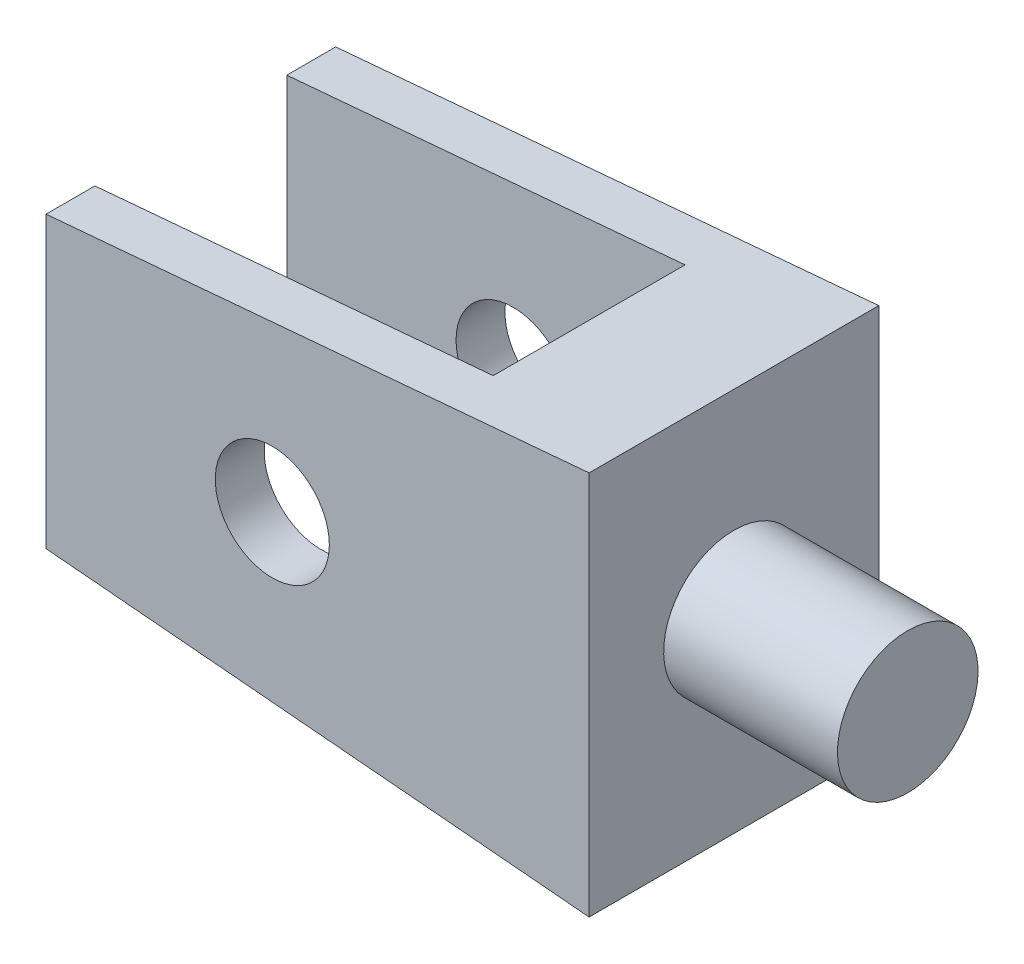
ISO-10303-21;
HEADER;
FILE_DESCRIPTION(('STEP AP214'),'2;1');
FILE_NAME('part.step','',(''),(''),'','','');
FILE_SCHEMA(('AUTOMOTIVE_DESIGN { 1 0 10303 214 1 1 1 1 }'));
ENDSEC;
DATA;
#1=APPLICATION_CONTEXT('core data for automotive mechanical design processes');
#2=APPLICATION_PROTOCOL_DEFINITION('international standard','automotive_design',2000,#1);
#3=PRODUCT_CONTEXT('',#1,'mechanical');
#4=PRODUCT('Part','Part','',(#3));
#5=PRODUCT_RELATED_PRODUCT_CATEGORY('part','',(#4));
#6=PRODUCT_DEFINITION_FORMATION('','',#4);
#7=PRODUCT_DEFINITION_CONTEXT('part definition',#1,'design');
#8=PRODUCT_DEFINITION('design','',#6,#7);
#9=PRODUCT_DEFINITION_SHAPE('','',#8);
#10=(LENGTH_UNIT() NAMED_UNIT(*) SI_UNIT(.MILLI.,.METRE.));
#11=(NAMED_UNIT(*) PLANE_ANGLE_UNIT() SI_UNIT($,.RADIAN.));
#12=(NAMED_UNIT(*) SI_UNIT($,.STERADIAN.) SOLID_ANGLE_UNIT());
#13=UNCERTAINTY_MEASURE_WITH_UNIT(LENGTH_MEASURE(1.E-05),#10,'distance_accuracy_value','');
#14=(GEOMETRIC_REPRESENTATION_CONTEXT(3) GLOBAL_UNCERTAINTY_ASSIGNED_CONTEXT((#13)) GLOBAL_UNIT_ASSIGNED_CONTEXT((#10,
#11,#12)) REPRESENTATION_CONTEXT('',''));
#15=CARTESIAN_POINT('',(0.,0.,0.));
#16=DIRECTION('',(0.,0.,1.));
#17=DIRECTION('',(1.,0.,0.));
#18=AXIS2_PLACEMENT_3D('',#15,#16,#17);
#19=CARTESIAN_POINT('',(0.,23.4932723213509,20.32));
#20=DIRECTION('',(0.0871557427476594,-0.996194698091745,0.));
#21=DIRECTION('',(0.996194698091746,0.0871557427476594,0.));
#22=AXIS2_PLACEMENT_3D('',#19,#20,#21);
#23=PLANE('',#22);
#24=DIRECTION('',(0.,0.,1.));
#25=VECTOR('',#24,1.);
#26=CARTESIAN_POINT('',(-114.3,13.4933180803377,20.32));
#27=LINE('',#26,#25);
#28=CARTESIAN_POINT('',(-114.3,13.4933180803377,0.));
#29=VERTEX_POINT('',#28);
#30=CARTESIAN_POINT('',(-114.3,13.4933180803377,20.32));
#31=VERTEX_POINT('',#30);
#32=EDGE_CURVE('E137',#29,#31,#27,.T.);
#33=ORIENTED_EDGE('',*,*,#32,.F.);
#34=DIRECTION('',(-0.996194698091745,-0.0871557427476594,0.));
#35=VECTOR('',#34,1.);
#36=CARTESIAN_POINT('',(0.,23.4932723213509,0.));
#37=LINE('',#36,#35);
#38=CARTESIAN_POINT('',(-152.4,10.1599999999999,0.));
#39=VERTEX_POINT('',#38);
#40=EDGE_CURVE('E100',#29,#39,#37,.T.);
#41=ORIENTED_EDGE('',*,*,#40,.T.);
#42=DIRECTION('',(0.,0.,-1.));
#43=VECTOR('',#42,1.);
#44=CARTESIAN_POINT('',(-152.4,10.1599999999999,20.32));
#45=LINE('',#44,#43);
#46=CARTESIAN_POINT('',(-152.4,10.16,3.429));
#47=VERTEX_POINT('',#46);
#48=EDGE_CURVE('E97',#47,#39,#45,.T.);
#49=ORIENTED_EDGE('',*,*,#48,.F.);
#50=DIRECTION('',(0.996194698091746,0.0871557427476594,0.));
#51=VECTOR('',#50,1.);
#52=CARTESIAN_POINT('',(0.,23.4932723213509,3.429));
#53=LINE('',#52,#51);
#54=CARTESIAN_POINT('',(-124.46,12.6044332589143,3.429));
#55=VERTEX_POINT('',#54);
#56=EDGE_CURVE('E164',#47,#55,#53,.T.);
#57=ORIENTED_EDGE('',*,*,#56,.T.);
#58=DIRECTION('',(0.,0.,1.));
#59=VECTOR('',#58,1.);
#60=CARTESIAN_POINT('',(-124.46,12.6044332589143,20.32));
#61=LINE('',#60,#59);
#62=CARTESIAN_POINT('',(-124.46,12.6044332589143,16.891));
#63=VERTEX_POINT('',#62);
#64=EDGE_CURVE('E170',#55,#63,#61,.T.);
#65=ORIENTED_EDGE('',*,*,#64,.T.);
#66=DIRECTION('',(-0.996194698091746,-0.0871557427476594,0.));
#67=VECTOR('',#66,1.);
#68=CARTESIAN_POINT('',(0.,23.4932723213509,16.891));
#69=LINE('',#68,#67);
#70=CARTESIAN_POINT('',(-152.4,10.16,16.891));
#71=VERTEX_POINT('',#70);
#72=EDGE_CURVE('E178',#63,#71,#69,.T.);
#73=ORIENTED_EDGE('',*,*,#72,.T.);
#74=CARTESIAN_POINT('',(-152.4,10.1599999999999,20.32));
#75=VERTEX_POINT('',#74);
#76=EDGE_CURVE('E110',#75,#71,#45,.T.);
#77=ORIENTED_EDGE('',*,*,#76,.F.);
#78=DIRECTION('',(-0.996194698091745,-0.0871557427476594,0.));
#79=VECTOR('',#78,1.);
#80=CARTESIAN_POINT('',(0.,23.4932723213509,20.32));
#81=LINE('',#80,#79);
#82=EDGE_CURVE('E104',#31,#75,#81,.T.);
#83=ORIENTED_EDGE('',*,*,#82,.F.);
#84=EDGE_LOOP('',(#33,#41,#49,#57,#65,#73,#77,#83));
#85=FACE_BOUND('',#84,.T.);
#86=ADVANCED_FACE('F39',(#85),#23,.F.);
#87=CARTESIAN_POINT('',(-152.4,-10.1600000000001,20.32));
#88=DIRECTION('',(0.0871557427476576,0.996194698091746,0.));
#89=DIRECTION('',(-0.996194698091746,0.0871557427476576,0.));
#90=AXIS2_PLACEMENT_3D('',#87,#88,#89);
#91=PLANE('',#90);
#92=DIRECTION('',(0.,0.,-1.));
#93=VECTOR('',#92,1.);
#94=CARTESIAN_POINT('',(-114.3,-13.4933180803378,20.32));
#95=LINE('',#94,#93);
#96=CARTESIAN_POINT('',(-114.3,-13.4933180803378,20.32));
#97=VERTEX_POINT('',#96);
#98=CARTESIAN_POINT('',(-114.3,-13.4933180803378,0.));
#99=VERTEX_POINT('',#98);
#100=EDGE_CURVE('E54',#97,#99,#95,.T.);
#101=ORIENTED_EDGE('',*,*,#100,.F.);
#102=DIRECTION('',(0.996194698091746,-0.0871557427476576,0.));
#103=VECTOR('',#102,1.);
#104=CARTESIAN_POINT('',(-152.4,-10.1600000000001,20.32));
#105=LINE('',#104,#103);
#106=CARTESIAN_POINT('',(-152.4,-10.1600000000001,20.32));
#107=VERTEX_POINT('',#106);
#108=EDGE_CURVE('E90',#107,#97,#105,.T.);
#109=ORIENTED_EDGE('',*,*,#108,.F.);
#110=DIRECTION('',(0.,0.,-1.));
#111=VECTOR('',#110,1.);
#112=CARTESIAN_POINT('',(-152.4,-10.1600000000001,20.32));
#113=LINE('',#112,#111);
#114=CARTESIAN_POINT('',(-152.4,-10.16,16.891));
#115=VERTEX_POINT('',#114);
#116=EDGE_CURVE('E89',#107,#115,#113,.T.);
#117=ORIENTED_EDGE('',*,*,#116,.T.);
#118=DIRECTION('',(0.996194698091746,-0.0871557427476576,0.));
#119=VECTOR('',#118,1.);
#120=CARTESIAN_POINT('',(-152.4,-10.1600000000001,16.891));
#121=LINE('',#120,#119);
#122=CARTESIAN_POINT('',(-124.46,-12.6044332589144,16.891));
#123=VERTEX_POINT('',#122);
#124=EDGE_CURVE('E180',#115,#123,#121,.T.);
#125=ORIENTED_EDGE('',*,*,#124,.T.);
#126=DIRECTION('',(0.,0.,-1.));
#127=VECTOR('',#126,1.);
#128=CARTESIAN_POINT('',(-124.46,-12.6044332589144,20.32));
#129=LINE('',#128,#127);
#130=CARTESIAN_POINT('',(-124.46,-12.6044332589144,3.429));
#131=VERTEX_POINT('',#130);
#132=EDGE_CURVE('E42',#123,#131,#129,.T.);
#133=ORIENTED_EDGE('',*,*,#132,.T.);
#134=DIRECTION('',(-0.996194698091746,0.0871557427476576,0.));
#135=VECTOR('',#134,1.);
#136=CARTESIAN_POINT('',(-152.4,-10.1600000000001,3.429));
#137=LINE('',#136,#135);
#138=CARTESIAN_POINT('',(-152.4,-10.16,3.429));
#139=VERTEX_POINT('',#138);
#140=EDGE_CURVE('E85',#131,#139,#137,.T.);
#141=ORIENTED_EDGE('',*,*,#140,.T.);
#142=CARTESIAN_POINT('',(-152.4,-10.1600000000001,0.));
#143=VERTEX_POINT('',#142);
#144=EDGE_CURVE('E77',#139,#143,#113,.T.);
#145=ORIENTED_EDGE('',*,*,#144,.T.);
#146=DIRECTION('',(0.996194698091746,-0.0871557427476576,0.));
#147=VECTOR('',#146,1.);
#148=CARTESIAN_POINT('',(-152.4,-10.1600000000001,0.));
#149=LINE('',#148,#147);
#150=EDGE_CURVE('E81',#143,#99,#149,.T.);
#151=ORIENTED_EDGE('',*,*,#150,.T.);
#152=EDGE_LOOP('',(#101,#109,#117,#125,#133,#141,#145,#151));
#153=FACE_BOUND('',#152,.T.);
#154=ADVANCED_FACE('F79',(#153),#91,.F.);
#155=CARTESIAN_POINT('',(0.,0.,20.32));
#156=DIRECTION('',(0.,0.,1.));
#157=DIRECTION('',(1.,0.,0.));
#158=AXIS2_PLACEMENT_3D('',#155,#156,#157);
#159=PLANE('',#158);
#160=CARTESIAN_POINT('',(-136.525,0.,20.32));
#161=DIRECTION('',(0.,0.,1.));
#162=DIRECTION('',(1.,0.,0.));
#163=AXIS2_PLACEMENT_3D('',#160,#161,#162);
#164=CIRCLE('',#163,3.99999999999999);
#165=CARTESIAN_POINT('',(-132.525,0.,20.32));
#166=VERTEX_POINT('',#165);
#167=EDGE_CURVE('E118',#166,#166,#164,.T.);
#168=ORIENTED_EDGE('',*,*,#167,.F.);
#169=EDGE_LOOP('',(#168));
#170=FACE_BOUND('',#169,.T.);
#171=ORIENTED_EDGE('',*,*,#108,.T.);
#172=DIRECTION('',(0.,1.,0.));
#173=VECTOR('',#172,1.);
#174=CARTESIAN_POINT('',(-114.3,0.,20.32));
#175=LINE('',#174,#173);
#176=EDGE_CURVE('E189',#97,#31,#175,.T.);
#177=ORIENTED_EDGE('',*,*,#176,.T.);
#178=ORIENTED_EDGE('',*,*,#82,.T.);
#179=DIRECTION('',(0.,-1.,0.));
#180=VECTOR('',#179,1.);
#181=CARTESIAN_POINT('',(-152.4,10.1599999999999,20.32));
#182=LINE('',#181,#180);
#183=EDGE_CURVE('E63',#75,#107,#182,.T.);
#184=ORIENTED_EDGE('',*,*,#183,.T.);
#185=EDGE_LOOP('',(#171,#177,#178,#184));
#186=FACE_BOUND('',#185,.T.);
#187=ADVANCED_FACE('F209',(#170,#186),#159,.T.);
#188=CARTESIAN_POINT('',(0.,0.,0.));
#189=DIRECTION('',(0.,0.,1.));
#190=DIRECTION('',(1.,0.,0.));
#191=AXIS2_PLACEMENT_3D('',#188,#189,#190);
#192=PLANE('',#191);
#193=CARTESIAN_POINT('',(-136.525,0.,0.));
#194=DIRECTION('',(0.,0.,1.));
#195=DIRECTION('',(1.,0.,0.));
#196=AXIS2_PLACEMENT_3D('',#193,#194,#195);
#197=CIRCLE('',#196,3.99999999999999);
#198=CARTESIAN_POINT('',(-132.525,0.,0.));
#199=VERTEX_POINT('',#198);
#200=EDGE_CURVE('E122',#199,#199,#197,.T.);
#201=ORIENTED_EDGE('',*,*,#200,.T.);
#202=EDGE_LOOP('',(#201));
#203=FACE_BOUND('',#202,.T.);
#204=DIRECTION('',(0.,-1.,0.));
#205=VECTOR('',#204,1.);
#206=CARTESIAN_POINT('',(-114.3,0.,0.));
#207=LINE('',#206,#205);
#208=EDGE_CURVE('E103',#29,#99,#207,.T.);
#209=ORIENTED_EDGE('',*,*,#208,.T.);
#210=ORIENTED_EDGE('',*,*,#150,.F.);
#211=DIRECTION('',(0.,-1.,0.));
#212=VECTOR('',#211,1.);
#213=CARTESIAN_POINT('',(-152.4,10.1599999999999,0.));
#214=LINE('',#213,#212);
#215=EDGE_CURVE('E94',#39,#143,#214,.T.);
#216=ORIENTED_EDGE('',*,*,#215,.F.);
#217=ORIENTED_EDGE('',*,*,#40,.F.);
#218=EDGE_LOOP('',(#209,#210,#216,#217));
#219=FACE_BOUND('',#218,.T.);
#220=ADVANCED_FACE('F102',(#203,#219),#192,.F.);
#221=CARTESIAN_POINT('',(-152.4,10.1599999999999,20.32));
#222=DIRECTION('',(1.,0.,0.));
#223=DIRECTION('',(0.,0.,-1.));
#224=AXIS2_PLACEMENT_3D('',#221,#222,#223);
#225=PLANE('',#224);
#226=ORIENTED_EDGE('',*,*,#76,.T.);
#227=DIRECTION('',(0.,1.,0.));
#228=VECTOR('',#227,1.);
#229=CARTESIAN_POINT('',(-152.4,-10.16,16.891));
#230=LINE('',#229,#228);
#231=EDGE_CURVE('E172',#115,#71,#230,.T.);
#232=ORIENTED_EDGE('',*,*,#231,.F.);
#233=ORIENTED_EDGE('',*,*,#116,.F.);
#234=ORIENTED_EDGE('',*,*,#183,.F.);
#235=EDGE_LOOP('',(#226,#232,#233,#234));
#236=FACE_BOUND('',#235,.T.);
#237=ADVANCED_FACE('F214',(#236),#225,.F.);
#238=CARTESIAN_POINT('',(-136.525,0.,0.));
#239=DIRECTION('',(0.,0.,1.));
#240=DIRECTION('',(1.,0.,0.));
#241=AXIS2_PLACEMENT_3D('',#238,#239,#240);
#242=CYLINDRICAL_SURFACE('',#241,3.99999999999999);
#243=CARTESIAN_POINT('',(-136.525,0.,16.891));
#244=DIRECTION('',(0.,0.,1.));
#245=DIRECTION('',(1.,0.,0.));
#246=AXIS2_PLACEMENT_3D('',#243,#244,#245);
#247=CIRCLE('',#246,3.99999999999999);
#248=CARTESIAN_POINT('',(-132.525,0.,16.891));
#249=VERTEX_POINT('',#248);
#250=EDGE_CURVE('E115',#249,#249,#247,.F.);
#251=ORIENTED_EDGE('',*,*,#250,.T.);
#252=EDGE_LOOP('',(#251));
#253=FACE_BOUND('',#252,.T.);
#254=ORIENTED_EDGE('',*,*,#167,.T.);
#255=EDGE_LOOP('',(#254));
#256=FACE_BOUND('',#255,.T.);
#257=ADVANCED_FACE('F239',(#253,#256),#242,.F.);
#258=ORIENTED_EDGE('',*,*,#144,.F.);
#259=DIRECTION('',(0.,-1.,0.));
#260=VECTOR('',#259,1.);
#261=CARTESIAN_POINT('',(-152.4,-10.16,3.429));
#262=LINE('',#261,#260);
#263=EDGE_CURVE('E116',#47,#139,#262,.T.);
#264=ORIENTED_EDGE('',*,*,#263,.F.);
#265=ORIENTED_EDGE('',*,*,#48,.T.);
#266=ORIENTED_EDGE('',*,*,#215,.T.);
#267=EDGE_LOOP('',(#258,#264,#265,#266));
#268=FACE_BOUND('',#267,.T.);
#269=ADVANCED_FACE('F95',(#268),#225,.F.);
#270=CARTESIAN_POINT('',(-136.525,0.,3.429));
#271=DIRECTION('',(0.,0.,-1.));
#272=DIRECTION('',(-1.,0.,0.));
#273=AXIS2_PLACEMENT_3D('',#270,#271,#272);
#274=CIRCLE('',#273,3.99999999999999);
#275=CARTESIAN_POINT('',(-140.525,0.,3.429));
#276=VERTEX_POINT('',#275);
#277=EDGE_CURVE('E113',#276,#276,#274,.F.);
#278=ORIENTED_EDGE('',*,*,#277,.T.);
#279=EDGE_LOOP('',(#278));
#280=FACE_BOUND('',#279,.T.);
#281=ORIENTED_EDGE('',*,*,#200,.F.);
#282=EDGE_LOOP('',(#281));
#283=FACE_BOUND('',#282,.T.);
#284=ADVANCED_FACE('F238',(#280,#283),#242,.F.);
#285=CARTESIAN_POINT('',(-127.,-10.16,16.891));
#286=DIRECTION('',(0.,0.,1.));
#287=DIRECTION('',(1.,0.,0.));
#288=AXIS2_PLACEMENT_3D('',#285,#286,#287);
#289=PLANE('',#288);
#290=ORIENTED_EDGE('',*,*,#124,.F.);
#291=ORIENTED_EDGE('',*,*,#231,.T.);
#292=ORIENTED_EDGE('',*,*,#72,.F.);
#293=DIRECTION('',(0.,1.,0.));
#294=VECTOR('',#293,1.);
#295=CARTESIAN_POINT('',(-124.46,-12.7,16.891));
#296=LINE('',#295,#294);
#297=EDGE_CURVE('E183',#123,#63,#296,.T.);
#298=ORIENTED_EDGE('',*,*,#297,.F.);
#299=EDGE_LOOP('',(#290,#291,#292,#298));
#300=FACE_BOUND('',#299,.T.);
#301=ORIENTED_EDGE('',*,*,#250,.F.);
#302=EDGE_LOOP('',(#301));
#303=FACE_BOUND('',#302,.T.);
#304=ADVANCED_FACE('F217',(#300,#303),#289,.F.);
#305=CARTESIAN_POINT('',(-127.,-10.16,3.429));
#306=DIRECTION('',(0.,0.,-1.));
#307=DIRECTION('',(-1.,0.,0.));
#308=AXIS2_PLACEMENT_3D('',#305,#306,#307);
#309=PLANE('',#308);
#310=ORIENTED_EDGE('',*,*,#263,.T.);
#311=ORIENTED_EDGE('',*,*,#140,.F.);
#312=DIRECTION('',(0.,1.,0.));
#313=VECTOR('',#312,1.);
#314=CARTESIAN_POINT('',(-124.46,-12.7,3.429));
#315=LINE('',#314,#313);
#316=EDGE_CURVE('E168',#131,#55,#315,.T.);
#317=ORIENTED_EDGE('',*,*,#316,.T.);
#318=ORIENTED_EDGE('',*,*,#56,.F.);
#319=EDGE_LOOP('',(#310,#311,#317,#318));
#320=FACE_BOUND('',#319,.T.);
#321=ORIENTED_EDGE('',*,*,#277,.F.);
#322=EDGE_LOOP('',(#321));
#323=FACE_BOUND('',#322,.T.);
#324=ADVANCED_FACE('F165',(#320,#323),#309,.F.);
#325=CARTESIAN_POINT('',(-124.46,-12.7,3.429));
#326=DIRECTION('',(1.,0.,0.));
#327=DIRECTION('',(0.,0.,-1.));
#328=AXIS2_PLACEMENT_3D('',#325,#326,#327);
#329=PLANE('',#328);
#330=ORIENTED_EDGE('',*,*,#316,.F.);
#331=ORIENTED_EDGE('',*,*,#132,.F.);
#332=ORIENTED_EDGE('',*,*,#297,.T.);
#333=ORIENTED_EDGE('',*,*,#64,.F.);
#334=EDGE_LOOP('',(#330,#331,#332,#333));
#335=FACE_BOUND('',#334,.T.);
#336=ADVANCED_FACE('F207',(#335),#329,.F.);
#337=CARTESIAN_POINT('',(-114.3,0.,30.48));
#338=DIRECTION('',(1.,0.,0.));
#339=DIRECTION('',(0.,1.,0.));
#340=AXIS2_PLACEMENT_3D('',#337,#338,#339);
#341=PLANE('',#340);
#342=CARTESIAN_POINT('',(-114.3,0.,10.16));
#343=DIRECTION('',(1.,0.,0.));
#344=DIRECTION('',(0.,1.,0.));
#345=AXIS2_PLACEMENT_3D('',#342,#343,#344);
#346=CIRCLE('',#345,4.93);
#347=CARTESIAN_POINT('',(-114.3,4.92999999999996,10.16));
#348=VERTEX_POINT('',#347);
#349=EDGE_CURVE('E11',#348,#348,#346,.T.);
#350=ORIENTED_EDGE('',*,*,#349,.F.);
#351=EDGE_LOOP('',(#350));
#352=FACE_BOUND('',#351,.T.);
#353=ORIENTED_EDGE('',*,*,#32,.T.);
#354=ORIENTED_EDGE('',*,*,#176,.F.);
#355=ORIENTED_EDGE('',*,*,#100,.T.);
#356=ORIENTED_EDGE('',*,*,#208,.F.);
#357=EDGE_LOOP('',(#353,#354,#355,#356));
#358=FACE_BOUND('',#357,.T.);
#359=ADVANCED_FACE('F202',(#352,#358),#341,.T.);
#360=CARTESIAN_POINT('',(-102.108,0.,10.16));
#361=DIRECTION('',(-1.,0.,0.));
#362=DIRECTION('',(0.,-1.,0.));
#363=AXIS2_PLACEMENT_3D('',#360,#361,#362);
#364=CYLINDRICAL_SURFACE('',#363,4.93);
#365=CARTESIAN_POINT('',(-102.108,0.,10.16));
#366=DIRECTION('',(1.,0.,0.));
#367=DIRECTION('',(0.,1.,0.));
#368=AXIS2_PLACEMENT_3D('',#365,#366,#367);
#369=CIRCLE('',#368,4.93);
#370=CARTESIAN_POINT('',(-102.108,4.92999999999996,10.16));
#371=VERTEX_POINT('',#370);
#372=EDGE_CURVE('E192',#371,#371,#369,.T.);
#373=ORIENTED_EDGE('',*,*,#372,.F.);
#374=EDGE_LOOP('',(#373));
#375=FACE_BOUND('',#374,.T.);
#376=ORIENTED_EDGE('',*,*,#349,.T.);
#377=EDGE_LOOP('',(#376));
#378=FACE_BOUND('',#377,.T.);
#379=ADVANCED_FACE('F199',(#375,#378),#364,.T.);
#380=CARTESIAN_POINT('',(-102.108,0.,10.16));
#381=DIRECTION('',(1.,0.,0.));
#382=DIRECTION('',(0.,1.,0.));
#383=AXIS2_PLACEMENT_3D('',#380,#381,#382);
#384=PLANE('',#383);
#385=ORIENTED_EDGE('',*,*,#372,.T.);
#386=EDGE_LOOP('',(#385));
#387=FACE_BOUND('',#386,.T.);
#388=ADVANCED_FACE('F197',(#387),#384,.T.);
#389=CLOSED_SHELL('',(#86,#154,#187,#220,#237,#257,#269,#284,#304,#324,#336,#359,#379,#388));
#390=MANIFOLD_SOLID_BREP('B2',#389);
#391=ADVANCED_BREP_SHAPE_REPRESENTATION('',(#18,#390),#14);
#392=SHAPE_DEFINITION_REPRESENTATION(#9,#391);
ENDSEC;
END-ISO-10303-21;
